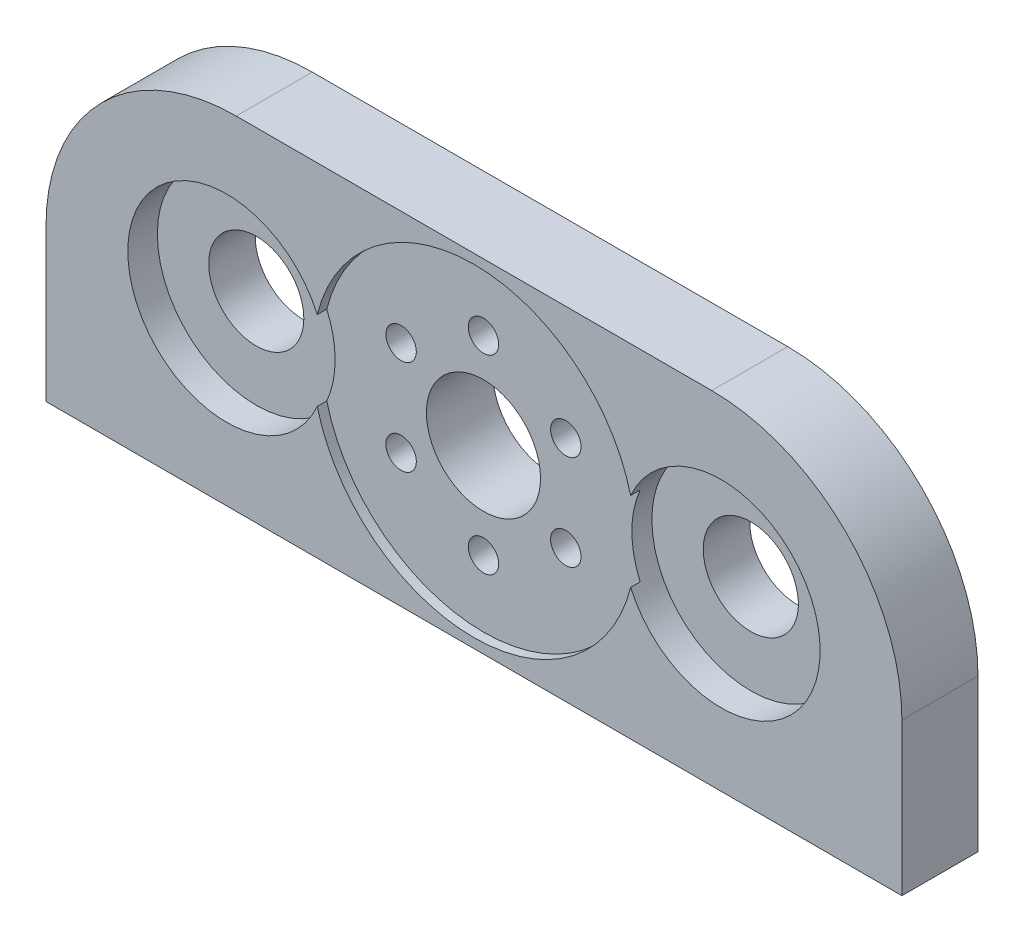
ISO-10303-21;
HEADER;
FILE_DESCRIPTION(('STEP AP214'),'2;1');
FILE_NAME('part.step','',(''),(''),'','','');
FILE_SCHEMA(('AUTOMOTIVE_DESIGN { 1 0 10303 214 1 1 1 1 }'));
ENDSEC;
DATA;
#1=APPLICATION_CONTEXT('core data for automotive mechanical design processes');
#2=APPLICATION_PROTOCOL_DEFINITION('international standard','automotive_design',2000,#1);
#3=PRODUCT_CONTEXT('',#1,'mechanical');
#4=PRODUCT('Part','Part','',(#3));
#5=PRODUCT_RELATED_PRODUCT_CATEGORY('part','',(#4));
#6=PRODUCT_DEFINITION_FORMATION('','',#4);
#7=PRODUCT_DEFINITION_CONTEXT('part definition',#1,'design');
#8=PRODUCT_DEFINITION('design','',#6,#7);
#9=PRODUCT_DEFINITION_SHAPE('','',#8);
#10=(LENGTH_UNIT() NAMED_UNIT(*) SI_UNIT(.MILLI.,.METRE.));
#11=(NAMED_UNIT(*) PLANE_ANGLE_UNIT() SI_UNIT($,.RADIAN.));
#12=(NAMED_UNIT(*) SI_UNIT($,.STERADIAN.) SOLID_ANGLE_UNIT());
#13=UNCERTAINTY_MEASURE_WITH_UNIT(LENGTH_MEASURE(1.E-05),#10,'distance_accuracy_value','');
#14=(GEOMETRIC_REPRESENTATION_CONTEXT(3) GLOBAL_UNCERTAINTY_ASSIGNED_CONTEXT((#13)) GLOBAL_UNIT_ASSIGNED_CONTEXT((#10,
#11,#12)) REPRESENTATION_CONTEXT('',''));
#15=CARTESIAN_POINT('',(0.,0.,0.));
#16=DIRECTION('',(0.,0.,1.));
#17=DIRECTION('',(1.,0.,0.));
#18=AXIS2_PLACEMENT_3D('',#15,#16,#17);
#19=CARTESIAN_POINT('',(-22.5,9.,-0.5));
#20=DIRECTION('',(0.,0.,1.));
#21=DIRECTION('',(1.,0.,0.));
#22=AXIS2_PLACEMENT_3D('',#19,#20,#21);
#23=CYLINDRICAL_SURFACE('',#22,8.5);
#24=CARTESIAN_POINT('',(-22.5,9.,-0.5));
#25=DIRECTION('',(0.,0.,1.));
#26=DIRECTION('',(1.,0.,0.));
#27=AXIS2_PLACEMENT_3D('',#24,#25,#26);
#28=CIRCLE('',#27,8.5);
#29=CARTESIAN_POINT('',(-14.2611538461538,11.0907926853838,-0.5));
#30=VERTEX_POINT('',#29);
#31=CARTESIAN_POINT('',(-30.7388461538462,11.0907926853838,-0.5));
#32=VERTEX_POINT('',#31);
#33=EDGE_CURVE('E128',#30,#32,#28,.T.);
#34=ORIENTED_EDGE('',*,*,#33,.F.);
#35=DIRECTION('',(0.,0.,1.));
#36=VECTOR('',#35,1.);
#37=CARTESIAN_POINT('',(-14.2611538461538,11.0907926853838,-0.7775));
#38=LINE('',#37,#36);
#39=CARTESIAN_POINT('',(-14.2611538461538,11.0907926853838,0.));
#40=VERTEX_POINT('',#39);
#41=EDGE_CURVE('E47',#30,#40,#38,.T.);
#42=ORIENTED_EDGE('',*,*,#41,.T.);
#43=CARTESIAN_POINT('',(-22.5,9.,0.));
#44=DIRECTION('',(0.,0.,1.));
#45=DIRECTION('',(1.,0.,0.));
#46=AXIS2_PLACEMENT_3D('',#43,#44,#45);
#47=CIRCLE('',#46,8.5);
#48=CARTESIAN_POINT('',(-30.7388461538462,11.0907926853838,0.));
#49=VERTEX_POINT('',#48);
#50=EDGE_CURVE('E124',#40,#49,#47,.T.);
#51=ORIENTED_EDGE('',*,*,#50,.T.);
#52=DIRECTION('',(0.,0.,1.));
#53=VECTOR('',#52,1.);
#54=CARTESIAN_POINT('',(-30.7388461538462,11.0907926853838,-0.7775));
#55=LINE('',#54,#53);
#56=EDGE_CURVE('E182',#49,#32,#55,.F.);
#57=ORIENTED_EDGE('',*,*,#56,.T.);
#58=EDGE_LOOP('',(#34,#42,#51,#57));
#59=FACE_BOUND('',#58,.T.);
#60=ADVANCED_FACE('F33',(#59),#23,.F.);
#61=CARTESIAN_POINT('',(-35.5,9.,-4.));
#62=DIRECTION('',(0.,0.,1.));
#63=DIRECTION('',(1.,0.,0.));
#64=AXIS2_PLACEMENT_3D('',#61,#62,#63);
#65=CYLINDRICAL_SURFACE('',#64,2.5);
#66=CARTESIAN_POINT('',(-35.5,9.,-4.));
#67=DIRECTION('',(0.,0.,1.));
#68=DIRECTION('',(1.,0.,0.));
#69=AXIS2_PLACEMENT_3D('',#66,#67,#68);
#70=CIRCLE('',#69,2.5);
#71=CARTESIAN_POINT('',(-33.,9.,-4.));
#72=VERTEX_POINT('',#71);
#73=EDGE_CURVE('E239',#72,#72,#70,.T.);
#74=ORIENTED_EDGE('',*,*,#73,.F.);
#75=EDGE_LOOP('',(#74));
#76=FACE_BOUND('',#75,.T.);
#77=CARTESIAN_POINT('',(-35.5,9.,-1.555));
#78=DIRECTION('',(0.,0.,1.));
#79=DIRECTION('',(1.,0.,0.));
#80=AXIS2_PLACEMENT_3D('',#77,#78,#79);
#81=CIRCLE('',#80,2.5);
#82=CARTESIAN_POINT('',(-33.,9.,-1.555));
#83=VERTEX_POINT('',#82);
#84=EDGE_CURVE('E179',#83,#83,#81,.F.);
#85=ORIENTED_EDGE('',*,*,#84,.F.);
#86=EDGE_LOOP('',(#85));
#87=FACE_BOUND('',#86,.T.);
#88=ADVANCED_FACE('F264',(#76,#87),#65,.F.);
#89=CARTESIAN_POINT('',(0.,18.,-4.));
#90=DIRECTION('',(0.,0.,1.));
#91=DIRECTION('',(1.,0.,0.));
#92=AXIS2_PLACEMENT_3D('',#89,#90,#91);
#93=PLANE('',#92);
#94=CARTESIAN_POINT('',(-26.8301270189219,6.49999999999986,-4.));
#95=DIRECTION('',(0.,0.,1.));
#96=DIRECTION('',(1.,0.,0.));
#97=AXIS2_PLACEMENT_3D('',#94,#95,#96);
#98=CIRCLE('',#97,0.800000000000003);
#99=CARTESIAN_POINT('',(-26.0301270189219,6.49999999999986,-4.));
#100=VERTEX_POINT('',#99);
#101=EDGE_CURVE('E200',#100,#100,#98,.T.);
#102=ORIENTED_EDGE('',*,*,#101,.T.);
#103=EDGE_LOOP('',(#102));
#104=FACE_BOUND('',#103,.T.);
#105=CARTESIAN_POINT('',(-22.4999999999996,4.,-4.));
#106=DIRECTION('',(0.,0.,1.));
#107=DIRECTION('',(1.,0.,0.));
#108=AXIS2_PLACEMENT_3D('',#105,#106,#107);
#109=CIRCLE('',#108,0.800000000000001);
#110=CARTESIAN_POINT('',(-21.6999999999996,4.,-4.));
#111=VERTEX_POINT('',#110);
#112=EDGE_CURVE('E204',#111,#111,#109,.T.);
#113=ORIENTED_EDGE('',*,*,#112,.T.);
#114=EDGE_LOOP('',(#113));
#115=FACE_BOUND('',#114,.T.);
#116=CARTESIAN_POINT('',(-18.1698729810775,6.50000000000016,-4.));
#117=DIRECTION('',(0.,0.,1.));
#118=DIRECTION('',(1.,0.,0.));
#119=AXIS2_PLACEMENT_3D('',#116,#117,#118);
#120=CIRCLE('',#119,0.799999999999998);
#121=CARTESIAN_POINT('',(-17.3698729810775,6.50000000000016,-4.));
#122=VERTEX_POINT('',#121);
#123=EDGE_CURVE('E210',#122,#122,#120,.T.);
#124=ORIENTED_EDGE('',*,*,#123,.T.);
#125=EDGE_LOOP('',(#124));
#126=FACE_BOUND('',#125,.T.);
#127=CARTESIAN_POINT('',(-18.1698729810777,11.5000000000002,-4.));
#128=DIRECTION('',(0.,0.,1.));
#129=DIRECTION('',(1.,0.,0.));
#130=AXIS2_PLACEMENT_3D('',#127,#128,#129);
#131=CIRCLE('',#130,0.799999999999995);
#132=CARTESIAN_POINT('',(-17.3698729810777,11.5000000000002,-4.));
#133=VERTEX_POINT('',#132);
#134=EDGE_CURVE('E216',#133,#133,#131,.T.);
#135=ORIENTED_EDGE('',*,*,#134,.T.);
#136=EDGE_LOOP('',(#135));
#137=FACE_BOUND('',#136,.T.);
#138=CARTESIAN_POINT('',(-22.5,14.,-4.));
#139=DIRECTION('',(0.,0.,1.));
#140=DIRECTION('',(1.,0.,0.));
#141=AXIS2_PLACEMENT_3D('',#138,#139,#140);
#142=CIRCLE('',#141,0.799999999999999);
#143=CARTESIAN_POINT('',(-21.7,14.,-4.));
#144=VERTEX_POINT('',#143);
#145=EDGE_CURVE('E222',#144,#144,#142,.T.);
#146=ORIENTED_EDGE('',*,*,#145,.T.);
#147=EDGE_LOOP('',(#146));
#148=FACE_BOUND('',#147,.T.);
#149=CARTESIAN_POINT('',(-26.8301270189221,11.4999999999999,-4.));
#150=DIRECTION('',(0.,0.,1.));
#151=DIRECTION('',(1.,0.,0.));
#152=AXIS2_PLACEMENT_3D('',#149,#150,#151);
#153=CIRCLE('',#152,0.800000000000003);
#154=CARTESIAN_POINT('',(-26.0301270189221,11.4999999999999,-4.));
#155=VERTEX_POINT('',#154);
#156=EDGE_CURVE('E231',#155,#155,#153,.T.);
#157=ORIENTED_EDGE('',*,*,#156,.T.);
#158=EDGE_LOOP('',(#157));
#159=FACE_BOUND('',#158,.T.);
#160=DIRECTION('',(-1.,0.,0.));
#161=VECTOR('',#160,1.);
#162=CARTESIAN_POINT('',(0.,18.,-4.));
#163=LINE('',#162,#161);
#164=CARTESIAN_POINT('',(-10.,18.,-4.));
#165=VERTEX_POINT('',#164);
#166=CARTESIAN_POINT('',(-35.,18.,-4.));
#167=VERTEX_POINT('',#166);
#168=EDGE_CURVE('E135',#165,#167,#163,.T.);
#169=ORIENTED_EDGE('',*,*,#168,.F.);
#170=CARTESIAN_POINT('',(-10.,8.,-4.));
#171=DIRECTION('',(0.,0.,1.));
#172=DIRECTION('',(1.,0.,0.));
#173=AXIS2_PLACEMENT_3D('',#170,#171,#172);
#174=CIRCLE('',#173,10.);
#175=CARTESIAN_POINT('',(0.,8.,-4.));
#176=VERTEX_POINT('',#175);
#177=EDGE_CURVE('E169',#165,#176,#174,.F.);
#178=ORIENTED_EDGE('',*,*,#177,.T.);
#179=DIRECTION('',(0.,-1.,0.));
#180=VECTOR('',#179,1.);
#181=CARTESIAN_POINT('',(0.,18.,-4.));
#182=LINE('',#181,#180);
#183=CARTESIAN_POINT('',(0.,0.,-4.));
#184=VERTEX_POINT('',#183);
#185=EDGE_CURVE('E159',#176,#184,#182,.T.);
#186=ORIENTED_EDGE('',*,*,#185,.T.);
#187=DIRECTION('',(-1.,0.,0.));
#188=VECTOR('',#187,1.);
#189=CARTESIAN_POINT('',(0.,0.,-4.));
#190=LINE('',#189,#188);
#191=CARTESIAN_POINT('',(-45.,0.,-3.99999999999999));
#192=VERTEX_POINT('',#191);
#193=EDGE_CURVE('E146',#184,#192,#190,.T.);
#194=ORIENTED_EDGE('',*,*,#193,.T.);
#195=DIRECTION('',(0.,-1.,0.));
#196=VECTOR('',#195,1.);
#197=CARTESIAN_POINT('',(-45.,18.,-3.99999999999999));
#198=LINE('',#197,#196);
#199=CARTESIAN_POINT('',(-45.,8.,-3.99999999999999));
#200=VERTEX_POINT('',#199);
#201=EDGE_CURVE('E157',#200,#192,#198,.T.);
#202=ORIENTED_EDGE('',*,*,#201,.F.);
#203=CARTESIAN_POINT('',(-35.,8.,-4.));
#204=DIRECTION('',(0.,0.,1.));
#205=DIRECTION('',(1.,0.,0.));
#206=AXIS2_PLACEMENT_3D('',#203,#204,#205);
#207=CIRCLE('',#206,10.);
#208=EDGE_CURVE('E167',#200,#167,#207,.F.);
#209=ORIENTED_EDGE('',*,*,#208,.T.);
#210=EDGE_LOOP('',(#169,#178,#186,#194,#202,#209));
#211=FACE_BOUND('',#210,.T.);
#212=CARTESIAN_POINT('',(-22.5,9.,-4.));
#213=DIRECTION('',(0.,0.,1.));
#214=DIRECTION('',(1.,0.,0.));
#215=AXIS2_PLACEMENT_3D('',#212,#213,#214);
#216=CIRCLE('',#215,3.);
#217=CARTESIAN_POINT('',(-19.5,9.,-4.));
#218=VERTEX_POINT('',#217);
#219=EDGE_CURVE('E132',#218,#218,#216,.T.);
#220=ORIENTED_EDGE('',*,*,#219,.T.);
#221=EDGE_LOOP('',(#220));
#222=FACE_BOUND('',#221,.T.);
#223=ORIENTED_EDGE('',*,*,#73,.T.);
#224=EDGE_LOOP('',(#223));
#225=FACE_BOUND('',#224,.T.);
#226=CARTESIAN_POINT('',(-9.5,9.,-4.));
#227=DIRECTION('',(0.,0.,-1.));
#228=DIRECTION('',(-1.,0.,0.));
#229=AXIS2_PLACEMENT_3D('',#226,#227,#228);
#230=CIRCLE('',#229,2.5);
#231=CARTESIAN_POINT('',(-12.,9.,-4.));
#232=VERTEX_POINT('',#231);
#233=EDGE_CURVE('E234',#232,#232,#230,.T.);
#234=ORIENTED_EDGE('',*,*,#233,.F.);
#235=EDGE_LOOP('',(#234));
#236=FACE_BOUND('',#235,.T.);
#237=ADVANCED_FACE('F269',(#104,#115,#126,#137,#148,#159,#211,#222,#225,#236),#93,.F.);
#238=CARTESIAN_POINT('',(0.,18.,0.));
#239=DIRECTION('',(0.,0.,-1.));
#240=DIRECTION('',(-1.,0.,0.));
#241=AXIS2_PLACEMENT_3D('',#238,#239,#240);
#242=PLANE('',#241);
#243=DIRECTION('',(0.,-1.,0.));
#244=VECTOR('',#243,1.);
#245=CARTESIAN_POINT('',(0.,18.,0.));
#246=LINE('',#245,#244);
#247=CARTESIAN_POINT('',(0.,8.,0.));
#248=VERTEX_POINT('',#247);
#249=CARTESIAN_POINT('',(0.,0.,0.));
#250=VERTEX_POINT('',#249);
#251=EDGE_CURVE('E142',#248,#250,#246,.T.);
#252=ORIENTED_EDGE('',*,*,#251,.F.);
#253=CARTESIAN_POINT('',(-10.,8.,0.));
#254=DIRECTION('',(0.,0.,-1.));
#255=DIRECTION('',(-1.,0.,0.));
#256=AXIS2_PLACEMENT_3D('',#253,#254,#255);
#257=CIRCLE('',#256,10.);
#258=CARTESIAN_POINT('',(-10.,18.,0.));
#259=VERTEX_POINT('',#258);
#260=EDGE_CURVE('E175',#248,#259,#257,.F.);
#261=ORIENTED_EDGE('',*,*,#260,.T.);
#262=DIRECTION('',(1.,0.,0.));
#263=VECTOR('',#262,1.);
#264=CARTESIAN_POINT('',(0.,18.,0.));
#265=LINE('',#264,#263);
#266=CARTESIAN_POINT('',(-35.,18.,0.));
#267=VERTEX_POINT('',#266);
#268=EDGE_CURVE('E138',#267,#259,#265,.T.);
#269=ORIENTED_EDGE('',*,*,#268,.F.);
#270=CARTESIAN_POINT('',(-35.,8.,0.));
#271=DIRECTION('',(0.,0.,-1.));
#272=DIRECTION('',(-1.,0.,0.));
#273=AXIS2_PLACEMENT_3D('',#270,#271,#272);
#274=CIRCLE('',#273,10.);
#275=CARTESIAN_POINT('',(-45.,8.,0.));
#276=VERTEX_POINT('',#275);
#277=EDGE_CURVE('E173',#267,#276,#274,.F.);
#278=ORIENTED_EDGE('',*,*,#277,.T.);
#279=DIRECTION('',(0.,-1.,0.));
#280=VECTOR('',#279,1.);
#281=CARTESIAN_POINT('',(-45.,18.,0.));
#282=LINE('',#281,#280);
#283=CARTESIAN_POINT('',(-45.,0.,0.));
#284=VERTEX_POINT('',#283);
#285=EDGE_CURVE('E155',#276,#284,#282,.T.);
#286=ORIENTED_EDGE('',*,*,#285,.T.);
#287=DIRECTION('',(1.,0.,0.));
#288=VECTOR('',#287,1.);
#289=CARTESIAN_POINT('',(0.,0.,0.));
#290=LINE('',#289,#288);
#291=EDGE_CURVE('E139',#284,#250,#290,.T.);
#292=ORIENTED_EDGE('',*,*,#291,.T.);
#293=EDGE_LOOP('',(#252,#261,#269,#278,#286,#292));
#294=FACE_BOUND('',#293,.T.);
#295=ORIENTED_EDGE('',*,*,#50,.F.);
#296=CARTESIAN_POINT('',(-9.5,8.99999999999998,0.));
#297=DIRECTION('',(0.,0.,1.));
#298=DIRECTION('',(-1.,0.,0.));
#299=AXIS2_PLACEMENT_3D('',#296,#297,#298);
#300=CIRCLE('',#299,5.2);
#301=CARTESIAN_POINT('',(-14.2611538461539,6.90920731461618,0.));
#302=VERTEX_POINT('',#301);
#303=EDGE_CURVE('E111',#302,#40,#300,.T.);
#304=ORIENTED_EDGE('',*,*,#303,.F.);
#305=CARTESIAN_POINT('',(-30.7388461538462,6.90920731461618,0.));
#306=VERTEX_POINT('',#305);
#307=EDGE_CURVE('E123',#306,#302,#47,.T.);
#308=ORIENTED_EDGE('',*,*,#307,.F.);
#309=CARTESIAN_POINT('',(-35.5,9.,0.));
#310=DIRECTION('',(0.,0.,1.));
#311=DIRECTION('',(1.,0.,0.));
#312=AXIS2_PLACEMENT_3D('',#309,#310,#311);
#313=CIRCLE('',#312,5.2);
#314=EDGE_CURVE('E193',#49,#306,#313,.T.);
#315=ORIENTED_EDGE('',*,*,#314,.F.);
#316=EDGE_LOOP('',(#295,#304,#308,#315));
#317=FACE_BOUND('',#316,.T.);
#318=ADVANCED_FACE('F121',(#294,#317),#242,.F.);
#319=CARTESIAN_POINT('',(0.,18.,0.));
#320=DIRECTION('',(-1.,0.,0.));
#321=DIRECTION('',(0.,0.,1.));
#322=AXIS2_PLACEMENT_3D('',#319,#320,#321);
#323=PLANE('',#322);
#324=ORIENTED_EDGE('',*,*,#185,.F.);
#325=DIRECTION('',(0.,0.,-1.));
#326=VECTOR('',#325,1.);
#327=CARTESIAN_POINT('',(0.,8.,0.));
#328=LINE('',#327,#326);
#329=EDGE_CURVE('E171',#176,#248,#328,.F.);
#330=ORIENTED_EDGE('',*,*,#329,.T.);
#331=ORIENTED_EDGE('',*,*,#251,.T.);
#332=DIRECTION('',(0.,0.,-1.));
#333=VECTOR('',#332,1.);
#334=CARTESIAN_POINT('',(0.,0.,0.));
#335=LINE('',#334,#333);
#336=EDGE_CURVE('E143',#250,#184,#335,.T.);
#337=ORIENTED_EDGE('',*,*,#336,.T.);
#338=EDGE_LOOP('',(#324,#330,#331,#337));
#339=FACE_BOUND('',#338,.T.);
#340=ADVANCED_FACE('F284',(#339),#323,.F.);
#341=CARTESIAN_POINT('',(-45.,18.,0.));
#342=DIRECTION('',(1.,0.,0.));
#343=DIRECTION('',(0.,0.,-1.));
#344=AXIS2_PLACEMENT_3D('',#341,#342,#343);
#345=PLANE('',#344);
#346=ORIENTED_EDGE('',*,*,#285,.F.);
#347=DIRECTION('',(0.,0.,1.));
#348=VECTOR('',#347,1.);
#349=CARTESIAN_POINT('',(-45.,8.,-3.99999999999999));
#350=LINE('',#349,#348);
#351=EDGE_CURVE('E177',#276,#200,#350,.F.);
#352=ORIENTED_EDGE('',*,*,#351,.T.);
#353=ORIENTED_EDGE('',*,*,#201,.T.);
#354=DIRECTION('',(0.,0.,1.));
#355=VECTOR('',#354,1.);
#356=CARTESIAN_POINT('',(-45.,0.,0.));
#357=LINE('',#356,#355);
#358=EDGE_CURVE('E149',#192,#284,#357,.T.);
#359=ORIENTED_EDGE('',*,*,#358,.T.);
#360=EDGE_LOOP('',(#346,#352,#353,#359));
#361=FACE_BOUND('',#360,.T.);
#362=ADVANCED_FACE('F277',(#361),#345,.F.);
#363=CARTESIAN_POINT('',(0.,18.,0.));
#364=DIRECTION('',(0.,1.,0.));
#365=DIRECTION('',(0.,0.,1.));
#366=AXIS2_PLACEMENT_3D('',#363,#364,#365);
#367=PLANE('',#366);
#368=ORIENTED_EDGE('',*,*,#268,.T.);
#369=DIRECTION('',(0.,0.,-1.));
#370=VECTOR('',#369,1.);
#371=CARTESIAN_POINT('',(-10.,18.,-4.));
#372=LINE('',#371,#370);
#373=EDGE_CURVE('E164',#259,#165,#372,.T.);
#374=ORIENTED_EDGE('',*,*,#373,.T.);
#375=ORIENTED_EDGE('',*,*,#168,.T.);
#376=DIRECTION('',(0.,0.,1.));
#377=VECTOR('',#376,1.);
#378=CARTESIAN_POINT('',(-35.,18.,0.));
#379=LINE('',#378,#377);
#380=EDGE_CURVE('E161',#167,#267,#379,.T.);
#381=ORIENTED_EDGE('',*,*,#380,.T.);
#382=EDGE_LOOP('',(#368,#374,#375,#381));
#383=FACE_BOUND('',#382,.T.);
#384=ADVANCED_FACE('F274',(#383),#367,.T.);
#385=CARTESIAN_POINT('',(0.,0.,0.));
#386=DIRECTION('',(0.,1.,0.));
#387=DIRECTION('',(0.,0.,1.));
#388=AXIS2_PLACEMENT_3D('',#385,#386,#387);
#389=PLANE('',#388);
#390=ORIENTED_EDGE('',*,*,#336,.F.);
#391=ORIENTED_EDGE('',*,*,#291,.F.);
#392=ORIENTED_EDGE('',*,*,#358,.F.);
#393=ORIENTED_EDGE('',*,*,#193,.F.);
#394=EDGE_LOOP('',(#390,#391,#392,#393));
#395=FACE_BOUND('',#394,.T.);
#396=ADVANCED_FACE('F260',(#395),#389,.F.);
#397=ORIENTED_EDGE('',*,*,#307,.T.);
#398=DIRECTION('',(0.,0.,1.));
#399=VECTOR('',#398,1.);
#400=CARTESIAN_POINT('',(-14.2611538461539,6.90920731461619,-0.7775));
#401=LINE('',#400,#399);
#402=CARTESIAN_POINT('',(-14.2611538461538,6.90920731461619,-0.5));
#403=VERTEX_POINT('',#402);
#404=EDGE_CURVE('E108',#302,#403,#401,.F.);
#405=ORIENTED_EDGE('',*,*,#404,.T.);
#406=CARTESIAN_POINT('',(-30.7388461538462,6.90920731461618,-0.5));
#407=VERTEX_POINT('',#406);
#408=EDGE_CURVE('E130',#407,#403,#28,.T.);
#409=ORIENTED_EDGE('',*,*,#408,.F.);
#410=DIRECTION('',(0.,0.,1.));
#411=VECTOR('',#410,1.);
#412=CARTESIAN_POINT('',(-30.7388461538462,6.90920731461618,-0.7775));
#413=LINE('',#412,#411);
#414=EDGE_CURVE('E55',#407,#306,#413,.T.);
#415=ORIENTED_EDGE('',*,*,#414,.T.);
#416=EDGE_LOOP('',(#397,#405,#409,#415));
#417=FACE_BOUND('',#416,.T.);
#418=ADVANCED_FACE('F127',(#417),#23,.F.);
#419=CARTESIAN_POINT('',(-22.5,9.,-0.5));
#420=DIRECTION('',(0.,0.,1.));
#421=DIRECTION('',(1.,0.,0.));
#422=AXIS2_PLACEMENT_3D('',#419,#420,#421);
#423=PLANE('',#422);
#424=CARTESIAN_POINT('',(-9.5,8.99999999999998,-0.5));
#425=DIRECTION('',(0.,0.,1.));
#426=DIRECTION('',(1.,0.,0.));
#427=AXIS2_PLACEMENT_3D('',#424,#425,#426);
#428=CIRCLE('',#427,5.2);
#429=EDGE_CURVE('E11',#30,#403,#428,.T.);
#430=ORIENTED_EDGE('',*,*,#429,.F.);
#431=ORIENTED_EDGE('',*,*,#33,.T.);
#432=CARTESIAN_POINT('',(-35.5,9.,-0.5));
#433=DIRECTION('',(0.,0.,1.));
#434=DIRECTION('',(1.,0.,0.));
#435=AXIS2_PLACEMENT_3D('',#432,#433,#434);
#436=CIRCLE('',#435,5.2);
#437=EDGE_CURVE('E41',#407,#32,#436,.T.);
#438=ORIENTED_EDGE('',*,*,#437,.F.);
#439=ORIENTED_EDGE('',*,*,#408,.T.);
#440=EDGE_LOOP('',(#430,#431,#438,#439));
#441=FACE_BOUND('',#440,.T.);
#442=CARTESIAN_POINT('',(-26.8301270189219,6.49999999999986,-0.5));
#443=DIRECTION('',(0.,0.,1.));
#444=DIRECTION('',(1.,0.,0.));
#445=AXIS2_PLACEMENT_3D('',#442,#443,#444);
#446=CIRCLE('',#445,0.800000000000003);
#447=CARTESIAN_POINT('',(-26.0301270189219,6.49999999999986,-0.5));
#448=VERTEX_POINT('',#447);
#449=EDGE_CURVE('E201',#448,#448,#446,.T.);
#450=ORIENTED_EDGE('',*,*,#449,.F.);
#451=EDGE_LOOP('',(#450));
#452=FACE_BOUND('',#451,.T.);
#453=CARTESIAN_POINT('',(-22.4999999999996,4.,-0.5));
#454=DIRECTION('',(0.,0.,1.));
#455=DIRECTION('',(1.,0.,0.));
#456=AXIS2_PLACEMENT_3D('',#453,#454,#455);
#457=CIRCLE('',#456,0.800000000000001);
#458=CARTESIAN_POINT('',(-21.6999999999996,4.,-0.5));
#459=VERTEX_POINT('',#458);
#460=EDGE_CURVE('E207',#459,#459,#457,.T.);
#461=ORIENTED_EDGE('',*,*,#460,.F.);
#462=EDGE_LOOP('',(#461));
#463=FACE_BOUND('',#462,.T.);
#464=CARTESIAN_POINT('',(-18.1698729810775,6.50000000000016,-0.5));
#465=DIRECTION('',(0.,0.,1.));
#466=DIRECTION('',(1.,0.,0.));
#467=AXIS2_PLACEMENT_3D('',#464,#465,#466);
#468=CIRCLE('',#467,0.799999999999998);
#469=CARTESIAN_POINT('',(-17.3698729810775,6.50000000000016,-0.5));
#470=VERTEX_POINT('',#469);
#471=EDGE_CURVE('E213',#470,#470,#468,.T.);
#472=ORIENTED_EDGE('',*,*,#471,.F.);
#473=EDGE_LOOP('',(#472));
#474=FACE_BOUND('',#473,.T.);
#475=CARTESIAN_POINT('',(-18.1698729810777,11.5000000000002,-0.5));
#476=DIRECTION('',(0.,0.,1.));
#477=DIRECTION('',(1.,0.,0.));
#478=AXIS2_PLACEMENT_3D('',#475,#476,#477);
#479=CIRCLE('',#478,0.799999999999995);
#480=CARTESIAN_POINT('',(-17.3698729810777,11.5000000000002,-0.5));
#481=VERTEX_POINT('',#480);
#482=EDGE_CURVE('E219',#481,#481,#479,.T.);
#483=ORIENTED_EDGE('',*,*,#482,.F.);
#484=EDGE_LOOP('',(#483));
#485=FACE_BOUND('',#484,.T.);
#486=CARTESIAN_POINT('',(-22.5,14.,-0.5));
#487=DIRECTION('',(0.,0.,1.));
#488=DIRECTION('',(1.,0.,0.));
#489=AXIS2_PLACEMENT_3D('',#486,#487,#488);
#490=CIRCLE('',#489,0.799999999999999);
#491=CARTESIAN_POINT('',(-21.7,14.,-0.5));
#492=VERTEX_POINT('',#491);
#493=EDGE_CURVE('E225',#492,#492,#490,.T.);
#494=ORIENTED_EDGE('',*,*,#493,.F.);
#495=EDGE_LOOP('',(#494));
#496=FACE_BOUND('',#495,.T.);
#497=CARTESIAN_POINT('',(-26.8301270189221,11.4999999999999,-0.5));
#498=DIRECTION('',(0.,0.,1.));
#499=DIRECTION('',(1.,0.,0.));
#500=AXIS2_PLACEMENT_3D('',#497,#498,#499);
#501=CIRCLE('',#500,0.800000000000003);
#502=CARTESIAN_POINT('',(-26.0301270189221,11.4999999999999,-0.5));
#503=VERTEX_POINT('',#502);
#504=EDGE_CURVE('E228',#503,#503,#501,.T.);
#505=ORIENTED_EDGE('',*,*,#504,.F.);
#506=EDGE_LOOP('',(#505));
#507=FACE_BOUND('',#506,.T.);
#508=CARTESIAN_POINT('',(-22.5,9.,-0.5));
#509=DIRECTION('',(0.,0.,1.));
#510=DIRECTION('',(1.,0.,0.));
#511=AXIS2_PLACEMENT_3D('',#508,#509,#510);
#512=CIRCLE('',#511,3.);
#513=CARTESIAN_POINT('',(-19.5,9.,-0.5));
#514=VERTEX_POINT('',#513);
#515=EDGE_CURVE('E242',#514,#514,#512,.T.);
#516=ORIENTED_EDGE('',*,*,#515,.F.);
#517=EDGE_LOOP('',(#516));
#518=FACE_BOUND('',#517,.T.);
#519=ADVANCED_FACE('F249',(#441,#452,#463,#474,#485,#496,#507,#518),#423,.T.);
#520=CARTESIAN_POINT('',(-22.5,9.,-4.));
#521=DIRECTION('',(0.,0.,1.));
#522=DIRECTION('',(1.,0.,0.));
#523=AXIS2_PLACEMENT_3D('',#520,#521,#522);
#524=CYLINDRICAL_SURFACE('',#523,3.);
#525=ORIENTED_EDGE('',*,*,#219,.F.);
#526=EDGE_LOOP('',(#525));
#527=FACE_BOUND('',#526,.T.);
#528=ORIENTED_EDGE('',*,*,#515,.T.);
#529=EDGE_LOOP('',(#528));
#530=FACE_BOUND('',#529,.T.);
#531=ADVANCED_FACE('F247',(#527,#530),#524,.F.);
#532=CARTESIAN_POINT('',(-9.5,9.,-4.));
#533=DIRECTION('',(0.,0.,1.));
#534=DIRECTION('',(1.,0.,0.));
#535=AXIS2_PLACEMENT_3D('',#532,#533,#534);
#536=CYLINDRICAL_SURFACE('',#535,2.5);
#537=CARTESIAN_POINT('',(-9.5,9.,-1.555));
#538=DIRECTION('',(0.,0.,-1.));
#539=DIRECTION('',(-1.,0.,0.));
#540=AXIS2_PLACEMENT_3D('',#537,#538,#539);
#541=CIRCLE('',#540,2.5);
#542=CARTESIAN_POINT('',(-12.,9.,-1.555));
#543=VERTEX_POINT('',#542);
#544=EDGE_CURVE('E116',#543,#543,#541,.T.);
#545=ORIENTED_EDGE('',*,*,#544,.F.);
#546=EDGE_LOOP('',(#545));
#547=FACE_BOUND('',#546,.T.);
#548=ORIENTED_EDGE('',*,*,#233,.T.);
#549=EDGE_LOOP('',(#548));
#550=FACE_BOUND('',#549,.T.);
#551=ADVANCED_FACE('F257',(#547,#550),#536,.F.);
#552=CARTESIAN_POINT('',(-26.8301270189221,11.4999999999999,-4.));
#553=DIRECTION('',(0.,0.,1.));
#554=DIRECTION('',(1.,0.,0.));
#555=AXIS2_PLACEMENT_3D('',#552,#553,#554);
#556=CYLINDRICAL_SURFACE('',#555,0.800000000000003);
#557=ORIENTED_EDGE('',*,*,#156,.F.);
#558=EDGE_LOOP('',(#557));
#559=FACE_BOUND('',#558,.T.);
#560=ORIENTED_EDGE('',*,*,#504,.T.);
#561=EDGE_LOOP('',(#560));
#562=FACE_BOUND('',#561,.T.);
#563=ADVANCED_FACE('F332',(#559,#562),#556,.F.);
#564=CARTESIAN_POINT('',(-22.5,14.,-4.));
#565=DIRECTION('',(0.,0.,1.));
#566=DIRECTION('',(1.,0.,0.));
#567=AXIS2_PLACEMENT_3D('',#564,#565,#566);
#568=CYLINDRICAL_SURFACE('',#567,0.799999999999999);
#569=ORIENTED_EDGE('',*,*,#145,.F.);
#570=EDGE_LOOP('',(#569));
#571=FACE_BOUND('',#570,.T.);
#572=ORIENTED_EDGE('',*,*,#493,.T.);
#573=EDGE_LOOP('',(#572));
#574=FACE_BOUND('',#573,.T.);
#575=ADVANCED_FACE('F338',(#571,#574),#568,.F.);
#576=CARTESIAN_POINT('',(-18.1698729810777,11.5000000000002,-4.));
#577=DIRECTION('',(0.,0.,1.));
#578=DIRECTION('',(1.,0.,0.));
#579=AXIS2_PLACEMENT_3D('',#576,#577,#578);
#580=CYLINDRICAL_SURFACE('',#579,0.799999999999995);
#581=ORIENTED_EDGE('',*,*,#134,.F.);
#582=EDGE_LOOP('',(#581));
#583=FACE_BOUND('',#582,.T.);
#584=ORIENTED_EDGE('',*,*,#482,.T.);
#585=EDGE_LOOP('',(#584));
#586=FACE_BOUND('',#585,.T.);
#587=ADVANCED_FACE('F344',(#583,#586),#580,.F.);
#588=CARTESIAN_POINT('',(-18.1698729810775,6.50000000000016,-4.));
#589=DIRECTION('',(0.,0.,1.));
#590=DIRECTION('',(1.,0.,0.));
#591=AXIS2_PLACEMENT_3D('',#588,#589,#590);
#592=CYLINDRICAL_SURFACE('',#591,0.799999999999998);
#593=ORIENTED_EDGE('',*,*,#123,.F.);
#594=EDGE_LOOP('',(#593));
#595=FACE_BOUND('',#594,.T.);
#596=ORIENTED_EDGE('',*,*,#471,.T.);
#597=EDGE_LOOP('',(#596));
#598=FACE_BOUND('',#597,.T.);
#599=ADVANCED_FACE('F348',(#595,#598),#592,.F.);
#600=CARTESIAN_POINT('',(-22.4999999999996,4.,-4.));
#601=DIRECTION('',(0.,0.,1.));
#602=DIRECTION('',(1.,0.,0.));
#603=AXIS2_PLACEMENT_3D('',#600,#601,#602);
#604=CYLINDRICAL_SURFACE('',#603,0.800000000000001);
#605=ORIENTED_EDGE('',*,*,#112,.F.);
#606=EDGE_LOOP('',(#605));
#607=FACE_BOUND('',#606,.T.);
#608=ORIENTED_EDGE('',*,*,#460,.T.);
#609=EDGE_LOOP('',(#608));
#610=FACE_BOUND('',#609,.T.);
#611=ADVANCED_FACE('F304',(#607,#610),#604,.F.);
#612=CARTESIAN_POINT('',(-26.8301270189219,6.49999999999986,-4.));
#613=DIRECTION('',(0.,0.,1.));
#614=DIRECTION('',(1.,0.,0.));
#615=AXIS2_PLACEMENT_3D('',#612,#613,#614);
#616=CYLINDRICAL_SURFACE('',#615,0.800000000000003);
#617=ORIENTED_EDGE('',*,*,#101,.F.);
#618=EDGE_LOOP('',(#617));
#619=FACE_BOUND('',#618,.T.);
#620=ORIENTED_EDGE('',*,*,#449,.T.);
#621=EDGE_LOOP('',(#620));
#622=FACE_BOUND('',#621,.T.);
#623=ADVANCED_FACE('F296',(#619,#622),#616,.F.);
#624=CARTESIAN_POINT('',(-10.,8.,0.));
#625=DIRECTION('',(0.,0.,1.));
#626=DIRECTION('',(1.,0.,0.));
#627=AXIS2_PLACEMENT_3D('',#624,#625,#626);
#628=CYLINDRICAL_SURFACE('',#627,10.);
#629=ORIENTED_EDGE('',*,*,#260,.F.);
#630=ORIENTED_EDGE('',*,*,#329,.F.);
#631=ORIENTED_EDGE('',*,*,#177,.F.);
#632=ORIENTED_EDGE('',*,*,#373,.F.);
#633=EDGE_LOOP('',(#629,#630,#631,#632));
#634=FACE_BOUND('',#633,.T.);
#635=ADVANCED_FACE('F294',(#634),#628,.T.);
#636=CARTESIAN_POINT('',(-35.,8.,0.));
#637=DIRECTION('',(0.,0.,-1.));
#638=DIRECTION('',(-1.,0.,0.));
#639=AXIS2_PLACEMENT_3D('',#636,#637,#638);
#640=CYLINDRICAL_SURFACE('',#639,10.);
#641=ORIENTED_EDGE('',*,*,#208,.F.);
#642=ORIENTED_EDGE('',*,*,#351,.F.);
#643=ORIENTED_EDGE('',*,*,#277,.F.);
#644=ORIENTED_EDGE('',*,*,#380,.F.);
#645=EDGE_LOOP('',(#641,#642,#643,#644));
#646=FACE_BOUND('',#645,.T.);
#647=ADVANCED_FACE('F35',(#646),#640,.T.);
#648=CARTESIAN_POINT('',(-35.5,9.,-1.555));
#649=DIRECTION('',(0.,0.,1.));
#650=DIRECTION('',(1.,0.,0.));
#651=AXIS2_PLACEMENT_3D('',#648,#649,#650);
#652=CYLINDRICAL_SURFACE('',#651,5.2);
#653=CARTESIAN_POINT('',(-35.5,9.,-1.555));
#654=DIRECTION('',(0.,0.,1.));
#655=DIRECTION('',(1.,0.,0.));
#656=AXIS2_PLACEMENT_3D('',#653,#654,#655);
#657=CIRCLE('',#656,5.2);
#658=CARTESIAN_POINT('',(-30.3,9.,-1.555));
#659=VERTEX_POINT('',#658);
#660=EDGE_CURVE('E183',#659,#659,#657,.T.);
#661=ORIENTED_EDGE('',*,*,#660,.F.);
#662=EDGE_LOOP('',(#661));
#663=FACE_BOUND('',#662,.T.);
#664=ORIENTED_EDGE('',*,*,#437,.T.);
#665=ORIENTED_EDGE('',*,*,#56,.F.);
#666=ORIENTED_EDGE('',*,*,#314,.T.);
#667=ORIENTED_EDGE('',*,*,#414,.F.);
#668=EDGE_LOOP('',(#664,#665,#666,#667));
#669=FACE_BOUND('',#668,.T.);
#670=ADVANCED_FACE('F302',(#663,#669),#652,.F.);
#671=CARTESIAN_POINT('',(-35.5,9.,-1.555));
#672=DIRECTION('',(0.,0.,1.));
#673=DIRECTION('',(1.,0.,0.));
#674=AXIS2_PLACEMENT_3D('',#671,#672,#673);
#675=PLANE('',#674);
#676=ORIENTED_EDGE('',*,*,#660,.T.);
#677=EDGE_LOOP('',(#676));
#678=FACE_BOUND('',#677,.T.);
#679=ORIENTED_EDGE('',*,*,#84,.T.);
#680=EDGE_LOOP('',(#679));
#681=FACE_BOUND('',#680,.T.);
#682=ADVANCED_FACE('F358',(#678,#681),#675,.T.);
#683=CARTESIAN_POINT('',(-9.5,8.99999999999998,-1.555));
#684=DIRECTION('',(0.,0.,1.));
#685=DIRECTION('',(1.,0.,0.));
#686=AXIS2_PLACEMENT_3D('',#683,#684,#685);
#687=CYLINDRICAL_SURFACE('',#686,5.2);
#688=CARTESIAN_POINT('',(-9.5,8.99999999999998,-1.555));
#689=DIRECTION('',(0.,0.,1.));
#690=DIRECTION('',(-1.,0.,0.));
#691=AXIS2_PLACEMENT_3D('',#688,#689,#690);
#692=CIRCLE('',#691,5.2);
#693=CARTESIAN_POINT('',(-14.7,8.99999999999998,-1.555));
#694=VERTEX_POINT('',#693);
#695=EDGE_CURVE('E125',#694,#694,#692,.T.);
#696=ORIENTED_EDGE('',*,*,#695,.F.);
#697=EDGE_LOOP('',(#696));
#698=FACE_BOUND('',#697,.T.);
#699=ORIENTED_EDGE('',*,*,#429,.T.);
#700=ORIENTED_EDGE('',*,*,#404,.F.);
#701=ORIENTED_EDGE('',*,*,#303,.T.);
#702=ORIENTED_EDGE('',*,*,#41,.F.);
#703=EDGE_LOOP('',(#699,#700,#701,#702));
#704=FACE_BOUND('',#703,.T.);
#705=ADVANCED_FACE('F110',(#698,#704),#687,.F.);
#706=CARTESIAN_POINT('',(-9.5,8.99999999999998,-1.555));
#707=DIRECTION('',(0.,0.,-1.));
#708=DIRECTION('',(-1.,0.,0.));
#709=AXIS2_PLACEMENT_3D('',#706,#707,#708);
#710=PLANE('',#709);
#711=ORIENTED_EDGE('',*,*,#544,.T.);
#712=EDGE_LOOP('',(#711));
#713=FACE_BOUND('',#712,.T.);
#714=ORIENTED_EDGE('',*,*,#695,.T.);
#715=EDGE_LOOP('',(#714));
#716=FACE_BOUND('',#715,.T.);
#717=ADVANCED_FACE('F365',(#713,#716),#710,.F.);
#718=CLOSED_SHELL('',(#60,#88,#237,#318,#340,#362,#384,#396,#418,#519,#531,#551,#563,#575,#587,
#599,#611,#623,#635,#647,#670,#682,#705,#717));
#719=MANIFOLD_SOLID_BREP('B2',#718);
#720=ADVANCED_BREP_SHAPE_REPRESENTATION('',(#18,#719),#14);
#721=SHAPE_DEFINITION_REPRESENTATION(#9,#720);
ENDSEC;
END-ISO-10303-21;
